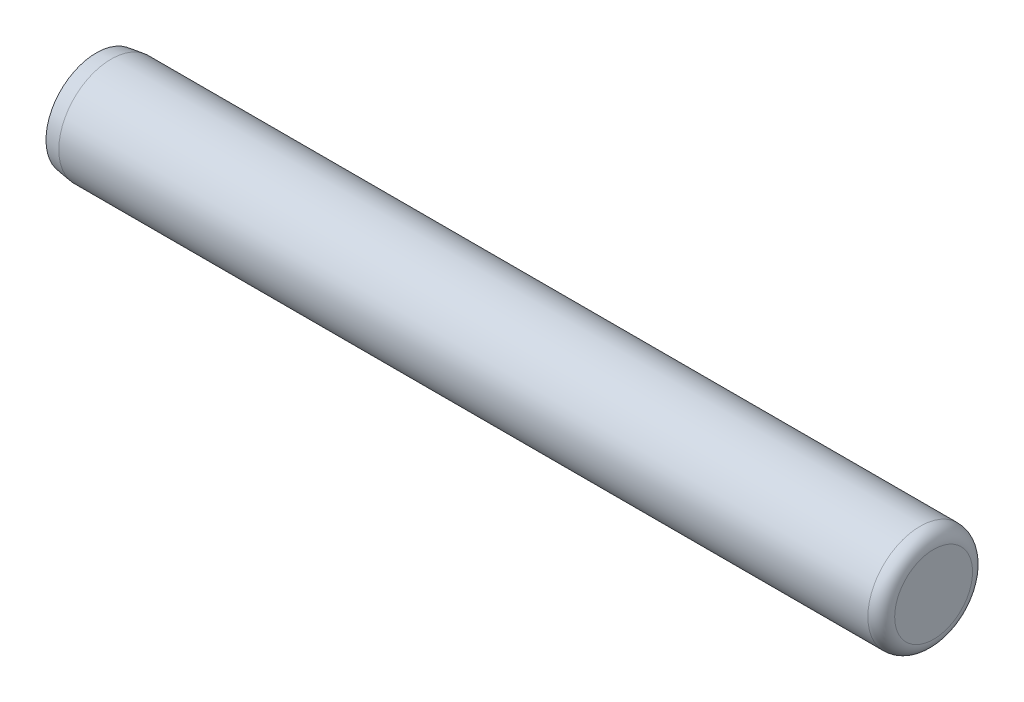
ISO-10303-21;
HEADER;
FILE_DESCRIPTION(('STEP AP214'),'2;1');
FILE_NAME('part.step','',(''),(''),'','','');
FILE_SCHEMA(('AUTOMOTIVE_DESIGN { 1 0 10303 214 1 1 1 1 }'));
ENDSEC;
DATA;
#1=APPLICATION_CONTEXT('core data for automotive mechanical design processes');
#2=APPLICATION_PROTOCOL_DEFINITION('international standard','automotive_design',2000,#1);
#3=PRODUCT_CONTEXT('',#1,'mechanical');
#4=PRODUCT('Part','Part','',(#3));
#5=PRODUCT_RELATED_PRODUCT_CATEGORY('part','',(#4));
#6=PRODUCT_DEFINITION_FORMATION('','',#4);
#7=PRODUCT_DEFINITION_CONTEXT('part definition',#1,'design');
#8=PRODUCT_DEFINITION('design','',#6,#7);
#9=PRODUCT_DEFINITION_SHAPE('','',#8);
#10=(LENGTH_UNIT() NAMED_UNIT(*) SI_UNIT(.MILLI.,.METRE.));
#11=(NAMED_UNIT(*) PLANE_ANGLE_UNIT() SI_UNIT($,.RADIAN.));
#12=(NAMED_UNIT(*) SI_UNIT($,.STERADIAN.) SOLID_ANGLE_UNIT());
#13=UNCERTAINTY_MEASURE_WITH_UNIT(LENGTH_MEASURE(1.E-05),#10,'distance_accuracy_value','');
#14=(GEOMETRIC_REPRESENTATION_CONTEXT(3) GLOBAL_UNCERTAINTY_ASSIGNED_CONTEXT((#13)) GLOBAL_UNIT_ASSIGNED_CONTEXT((#10,
#11,#12)) REPRESENTATION_CONTEXT('',''));
#15=CARTESIAN_POINT('',(0.,0.,0.));
#16=DIRECTION('',(0.,0.,1.));
#17=DIRECTION('',(1.,0.,0.));
#18=AXIS2_PLACEMENT_3D('',#15,#16,#17);
#19=CARTESIAN_POINT('',(-12.7,0.,0.));
#20=DIRECTION('',(1.,0.,0.));
#21=DIRECTION('',(0.,0.,-1.));
#22=AXIS2_PLACEMENT_3D('',#19,#20,#21);
#23=PLANE('',#22);
#24=CARTESIAN_POINT('',(-12.7,0.,0.));
#25=DIRECTION('',(-1.,0.,0.));
#26=DIRECTION('',(0.,0.,1.));
#27=AXIS2_PLACEMENT_3D('',#24,#25,#26);
#28=CIRCLE('',#27,1.524);
#29=CARTESIAN_POINT('',(-12.7,0.,1.524));
#30=VERTEX_POINT('',#29);
#31=EDGE_CURVE('E49',#30,#30,#28,.T.);
#32=ORIENTED_EDGE('',*,*,#31,.T.);
#33=EDGE_LOOP('',(#32));
#34=FACE_BOUND('',#33,.T.);
#35=ADVANCED_FACE('F35',(#34),#23,.F.);
#36=CARTESIAN_POINT('',(12.7,0.,0.));
#37=DIRECTION('',(-1.,0.,0.));
#38=DIRECTION('',(0.,0.,1.));
#39=AXIS2_PLACEMENT_3D('',#36,#37,#38);
#40=PLANE('',#39);
#41=CARTESIAN_POINT('',(12.7,0.,0.));
#42=DIRECTION('',(-1.,0.,0.));
#43=DIRECTION('',(0.,0.,1.));
#44=AXIS2_PLACEMENT_3D('',#41,#42,#43);
#45=CIRCLE('',#44,1.1811);
#46=CARTESIAN_POINT('',(12.7,0.,1.1811));
#47=VERTEX_POINT('',#46);
#48=EDGE_CURVE('E10',#47,#47,#45,.T.);
#49=ORIENTED_EDGE('',*,*,#48,.F.);
#50=EDGE_LOOP('',(#49));
#51=FACE_BOUND('',#50,.T.);
#52=ADVANCED_FACE('F69',(#51),#40,.F.);
#53=CARTESIAN_POINT('',(12.2936,0.,0.));
#54=DIRECTION('',(-1.,0.,0.));
#55=DIRECTION('',(0.,0.,1.));
#56=AXIS2_PLACEMENT_3D('',#53,#54,#55);
#57=TOROIDAL_SURFACE('',#56,1.1811,0.406400000000001);
#58=CARTESIAN_POINT('',(12.2936,0.,0.));
#59=DIRECTION('',(-1.,0.,0.));
#60=DIRECTION('',(0.,0.,1.));
#61=AXIS2_PLACEMENT_3D('',#58,#59,#60);
#62=CIRCLE('',#61,1.5875);
#63=CARTESIAN_POINT('',(12.2936,0.,1.5875));
#64=VERTEX_POINT('',#63);
#65=EDGE_CURVE('E41',#64,#64,#62,.T.);
#66=ORIENTED_EDGE('',*,*,#65,.F.);
#67=EDGE_LOOP('',(#66));
#68=FACE_BOUND('',#67,.T.);
#69=ORIENTED_EDGE('',*,*,#48,.T.);
#70=EDGE_LOOP('',(#69));
#71=FACE_BOUND('',#70,.T.);
#72=ADVANCED_FACE('F64',(#68,#71),#57,.T.);
#73=CARTESIAN_POINT('',(-12.7,0.,0.));
#74=DIRECTION('',(-1.,0.,0.));
#75=DIRECTION('',(0.,0.,1.));
#76=AXIS2_PLACEMENT_3D('',#73,#74,#75);
#77=CYLINDRICAL_SURFACE('',#76,1.5875);
#78=CARTESIAN_POINT('',(-12.2481740226286,0.,0.));
#79=DIRECTION('',(-1.,0.,0.));
#80=DIRECTION('',(0.,0.,1.));
#81=AXIS2_PLACEMENT_3D('',#78,#79,#80);
#82=CIRCLE('',#81,1.5875);
#83=CARTESIAN_POINT('',(-12.2481740226286,0.,1.5875));
#84=VERTEX_POINT('',#83);
#85=EDGE_CURVE('E45',#84,#84,#82,.T.);
#86=ORIENTED_EDGE('',*,*,#85,.F.);
#87=EDGE_LOOP('',(#86));
#88=FACE_BOUND('',#87,.T.);
#89=ORIENTED_EDGE('',*,*,#65,.T.);
#90=EDGE_LOOP('',(#89));
#91=FACE_BOUND('',#90,.T.);
#92=ADVANCED_FACE('F59',(#88,#91),#77,.T.);
#93=CARTESIAN_POINT('',(-12.2481740226286,0.,0.));
#94=DIRECTION('',(1.,0.,0.));
#95=DIRECTION('',(0.,0.,-1.));
#96=AXIS2_PLACEMENT_3D('',#93,#94,#95);
#97=CONICAL_SURFACE('',#96,1.5875,0.139626340159547);
#98=ORIENTED_EDGE('',*,*,#31,.F.);
#99=EDGE_LOOP('',(#98));
#100=FACE_BOUND('',#99,.T.);
#101=ORIENTED_EDGE('',*,*,#85,.T.);
#102=EDGE_LOOP('',(#101));
#103=FACE_BOUND('',#102,.T.);
#104=ADVANCED_FACE('F56',(#100,#103),#97,.T.);
#105=CLOSED_SHELL('',(#35,#52,#72,#92,#104));
#106=MANIFOLD_SOLID_BREP('B2',#105);
#107=ADVANCED_BREP_SHAPE_REPRESENTATION('',(#18,#106),#14);
#108=SHAPE_DEFINITION_REPRESENTATION(#9,#107);
ENDSEC;
END-ISO-10303-21;
